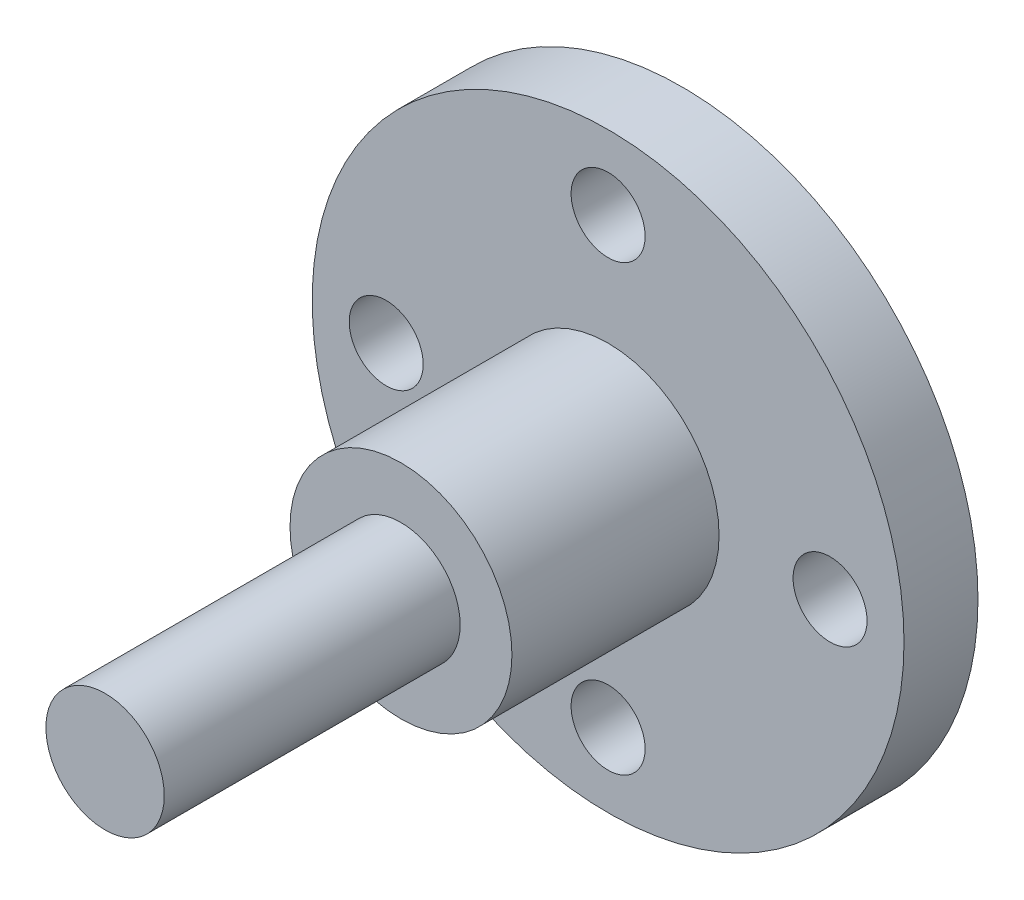
ISO-10303-21;
HEADER;
FILE_DESCRIPTION(('STEP AP214'),'2;1');
FILE_NAME('part.step','',(''),(''),'','','');
FILE_SCHEMA(('AUTOMOTIVE_DESIGN { 1 0 10303 214 1 1 1 1 }'));
ENDSEC;
DATA;
#1=APPLICATION_CONTEXT('core data for automotive mechanical design processes');
#2=APPLICATION_PROTOCOL_DEFINITION('international standard','automotive_design',2000,#1);
#3=PRODUCT_CONTEXT('',#1,'mechanical');
#4=PRODUCT('Part','Part','',(#3));
#5=PRODUCT_RELATED_PRODUCT_CATEGORY('part','',(#4));
#6=PRODUCT_DEFINITION_FORMATION('','',#4);
#7=PRODUCT_DEFINITION_CONTEXT('part definition',#1,'design');
#8=PRODUCT_DEFINITION('design','',#6,#7);
#9=PRODUCT_DEFINITION_SHAPE('','',#8);
#10=(LENGTH_UNIT() NAMED_UNIT(*) SI_UNIT(.MILLI.,.METRE.));
#11=(NAMED_UNIT(*) PLANE_ANGLE_UNIT() SI_UNIT($,.RADIAN.));
#12=(NAMED_UNIT(*) SI_UNIT($,.STERADIAN.) SOLID_ANGLE_UNIT());
#13=UNCERTAINTY_MEASURE_WITH_UNIT(LENGTH_MEASURE(1.E-05),#10,'distance_accuracy_value','');
#14=(GEOMETRIC_REPRESENTATION_CONTEXT(3) GLOBAL_UNCERTAINTY_ASSIGNED_CONTEXT((#13)) GLOBAL_UNIT_ASSIGNED_CONTEXT((#10,
#11,#12)) REPRESENTATION_CONTEXT('',''));
#15=CARTESIAN_POINT('',(0.,0.,0.));
#16=DIRECTION('',(0.,0.,1.));
#17=DIRECTION('',(1.,0.,0.));
#18=AXIS2_PLACEMENT_3D('',#15,#16,#17);
#19=CARTESIAN_POINT('',(0.,0.,5.));
#20=DIRECTION('',(0.,0.,-1.));
#21=DIRECTION('',(-1.,0.,0.));
#22=AXIS2_PLACEMENT_3D('',#19,#20,#21);
#23=CYLINDRICAL_SURFACE('',#22,20.);
#24=CARTESIAN_POINT('',(0.,0.,5.));
#25=DIRECTION('',(0.,0.,1.));
#26=DIRECTION('',(1.,0.,0.));
#27=AXIS2_PLACEMENT_3D('',#24,#25,#26);
#28=CIRCLE('',#27,20.);
#29=CARTESIAN_POINT('',(20.,0.,5.));
#30=VERTEX_POINT('',#29);
#31=EDGE_CURVE('E55',#30,#30,#28,.T.);
#32=ORIENTED_EDGE('',*,*,#31,.F.);
#33=EDGE_LOOP('',(#32));
#34=FACE_BOUND('',#33,.T.);
#35=CARTESIAN_POINT('',(0.,0.,0.));
#36=DIRECTION('',(0.,0.,1.));
#37=DIRECTION('',(1.,0.,0.));
#38=AXIS2_PLACEMENT_3D('',#35,#36,#37);
#39=CIRCLE('',#38,20.);
#40=CARTESIAN_POINT('',(20.,0.,0.));
#41=VERTEX_POINT('',#40);
#42=EDGE_CURVE('E64',#41,#41,#39,.T.);
#43=ORIENTED_EDGE('',*,*,#42,.T.);
#44=EDGE_LOOP('',(#43));
#45=FACE_BOUND('',#44,.T.);
#46=ADVANCED_FACE('F41',(#34,#45),#23,.T.);
#47=CARTESIAN_POINT('',(0.,0.,5.));
#48=DIRECTION('',(0.,0.,1.));
#49=DIRECTION('',(1.,0.,0.));
#50=AXIS2_PLACEMENT_3D('',#47,#48,#49);
#51=PLANE('',#50);
#52=CARTESIAN_POINT('',(0.,15.,5.));
#53=DIRECTION('',(0.,0.,1.));
#54=DIRECTION('',(1.,0.,0.));
#55=AXIS2_PLACEMENT_3D('',#52,#53,#54);
#56=CIRCLE('',#55,2.5);
#57=CARTESIAN_POINT('',(2.5,15.,5.));
#58=VERTEX_POINT('',#57);
#59=EDGE_CURVE('E77',#58,#58,#56,.T.);
#60=ORIENTED_EDGE('',*,*,#59,.F.);
#61=EDGE_LOOP('',(#60));
#62=FACE_BOUND('',#61,.T.);
#63=CARTESIAN_POINT('',(15.0000000000004,4.23570186157979E-13,5.));
#64=DIRECTION('',(0.,0.,1.));
#65=DIRECTION('',(1.,0.,0.));
#66=AXIS2_PLACEMENT_3D('',#63,#64,#65);
#67=CIRCLE('',#66,2.5);
#68=CARTESIAN_POINT('',(17.5000000000004,4.23570186157979E-13,5.));
#69=VERTEX_POINT('',#68);
#70=EDGE_CURVE('E156',#69,#69,#67,.T.);
#71=ORIENTED_EDGE('',*,*,#70,.F.);
#72=EDGE_LOOP('',(#71));
#73=FACE_BOUND('',#72,.T.);
#74=CARTESIAN_POINT('',(8.47140372315957E-13,-15.,5.));
#75=DIRECTION('',(0.,0.,1.));
#76=DIRECTION('',(1.,0.,0.));
#77=AXIS2_PLACEMENT_3D('',#74,#75,#76);
#78=CIRCLE('',#77,2.5);
#79=CARTESIAN_POINT('',(2.50000000000085,-15.,5.));
#80=VERTEX_POINT('',#79);
#81=EDGE_CURVE('E160',#80,#80,#78,.T.);
#82=ORIENTED_EDGE('',*,*,#81,.F.);
#83=EDGE_LOOP('',(#82));
#84=FACE_BOUND('',#83,.T.);
#85=CARTESIAN_POINT('',(-14.9999999999996,-4.254071563567E-13,5.));
#86=DIRECTION('',(0.,0.,1.));
#87=DIRECTION('',(1.,0.,0.));
#88=AXIS2_PLACEMENT_3D('',#85,#86,#87);
#89=CIRCLE('',#88,2.5);
#90=CARTESIAN_POINT('',(-12.4999999999996,-4.254071563567E-13,5.));
#91=VERTEX_POINT('',#90);
#92=EDGE_CURVE('E165',#91,#91,#89,.T.);
#93=ORIENTED_EDGE('',*,*,#92,.F.);
#94=EDGE_LOOP('',(#93));
#95=FACE_BOUND('',#94,.T.);
#96=CARTESIAN_POINT('',(0.,0.,5.));
#97=DIRECTION('',(0.,0.,1.));
#98=DIRECTION('',(1.,0.,0.));
#99=AXIS2_PLACEMENT_3D('',#96,#97,#98);
#100=CIRCLE('',#99,7.5);
#101=CARTESIAN_POINT('',(7.5,0.,5.));
#102=VERTEX_POINT('',#101);
#103=EDGE_CURVE('E49',#102,#102,#100,.T.);
#104=ORIENTED_EDGE('',*,*,#103,.F.);
#105=EDGE_LOOP('',(#104));
#106=FACE_BOUND('',#105,.T.);
#107=ORIENTED_EDGE('',*,*,#31,.T.);
#108=EDGE_LOOP('',(#107));
#109=FACE_BOUND('',#108,.T.);
#110=ADVANCED_FACE('F109',(#62,#73,#84,#95,#106,#109),#51,.T.);
#111=CARTESIAN_POINT('',(0.,0.,0.));
#112=DIRECTION('',(0.,0.,1.));
#113=DIRECTION('',(1.,0.,0.));
#114=AXIS2_PLACEMENT_3D('',#111,#112,#113);
#115=PLANE('',#114);
#116=CARTESIAN_POINT('',(0.,15.,0.));
#117=DIRECTION('',(0.,0.,1.));
#118=DIRECTION('',(1.,0.,0.));
#119=AXIS2_PLACEMENT_3D('',#116,#117,#118);
#120=CIRCLE('',#119,2.5);
#121=CARTESIAN_POINT('',(2.5,15.,0.));
#122=VERTEX_POINT('',#121);
#123=EDGE_CURVE('E44',#122,#122,#120,.T.);
#124=ORIENTED_EDGE('',*,*,#123,.T.);
#125=EDGE_LOOP('',(#124));
#126=FACE_BOUND('',#125,.T.);
#127=CARTESIAN_POINT('',(15.0000000000004,4.23570186157979E-13,0.));
#128=DIRECTION('',(0.,0.,1.));
#129=DIRECTION('',(1.,0.,0.));
#130=AXIS2_PLACEMENT_3D('',#127,#128,#129);
#131=CIRCLE('',#130,2.5);
#132=CARTESIAN_POINT('',(17.5000000000004,4.23570186157979E-13,0.));
#133=VERTEX_POINT('',#132);
#134=EDGE_CURVE('E80',#133,#133,#131,.T.);
#135=ORIENTED_EDGE('',*,*,#134,.T.);
#136=EDGE_LOOP('',(#135));
#137=FACE_BOUND('',#136,.T.);
#138=CARTESIAN_POINT('',(8.47140372315957E-13,-15.,0.));
#139=DIRECTION('',(0.,0.,1.));
#140=DIRECTION('',(1.,0.,0.));
#141=AXIS2_PLACEMENT_3D('',#138,#139,#140);
#142=CIRCLE('',#141,2.5);
#143=CARTESIAN_POINT('',(2.50000000000085,-15.,0.));
#144=VERTEX_POINT('',#143);
#145=EDGE_CURVE('E76',#144,#144,#142,.T.);
#146=ORIENTED_EDGE('',*,*,#145,.T.);
#147=EDGE_LOOP('',(#146));
#148=FACE_BOUND('',#147,.T.);
#149=CARTESIAN_POINT('',(-14.9999999999996,-4.254071563567E-13,0.));
#150=DIRECTION('',(0.,0.,1.));
#151=DIRECTION('',(1.,0.,0.));
#152=AXIS2_PLACEMENT_3D('',#149,#150,#151);
#153=CIRCLE('',#152,2.5);
#154=CARTESIAN_POINT('',(-12.4999999999996,-4.254071563567E-13,0.));
#155=VERTEX_POINT('',#154);
#156=EDGE_CURVE('E72',#155,#155,#153,.T.);
#157=ORIENTED_EDGE('',*,*,#156,.T.);
#158=EDGE_LOOP('',(#157));
#159=FACE_BOUND('',#158,.T.);
#160=ORIENTED_EDGE('',*,*,#42,.F.);
#161=EDGE_LOOP('',(#160));
#162=FACE_BOUND('',#161,.T.);
#163=ADVANCED_FACE('F114',(#126,#137,#148,#159,#162),#115,.F.);
#164=CARTESIAN_POINT('',(0.,0.,19.));
#165=DIRECTION('',(0.,0.,-1.));
#166=DIRECTION('',(-1.,0.,0.));
#167=AXIS2_PLACEMENT_3D('',#164,#165,#166);
#168=CYLINDRICAL_SURFACE('',#167,7.5);
#169=CARTESIAN_POINT('',(0.,0.,19.));
#170=DIRECTION('',(0.,0.,1.));
#171=DIRECTION('',(1.,0.,0.));
#172=AXIS2_PLACEMENT_3D('',#169,#170,#171);
#173=CIRCLE('',#172,7.5);
#174=CARTESIAN_POINT('',(7.5,0.,19.));
#175=VERTEX_POINT('',#174);
#176=EDGE_CURVE('E61',#175,#175,#173,.T.);
#177=ORIENTED_EDGE('',*,*,#176,.F.);
#178=EDGE_LOOP('',(#177));
#179=FACE_BOUND('',#178,.T.);
#180=ORIENTED_EDGE('',*,*,#103,.T.);
#181=EDGE_LOOP('',(#180));
#182=FACE_BOUND('',#181,.T.);
#183=ADVANCED_FACE('F105',(#179,#182),#168,.T.);
#184=CARTESIAN_POINT('',(0.,0.,19.));
#185=DIRECTION('',(0.,0.,1.));
#186=DIRECTION('',(1.,0.,0.));
#187=AXIS2_PLACEMENT_3D('',#184,#185,#186);
#188=PLANE('',#187);
#189=CARTESIAN_POINT('',(0.,0.,19.));
#190=DIRECTION('',(0.,0.,1.));
#191=DIRECTION('',(1.,0.,0.));
#192=AXIS2_PLACEMENT_3D('',#189,#190,#191);
#193=CIRCLE('',#192,4.);
#194=CARTESIAN_POINT('',(4.,0.,19.));
#195=VERTEX_POINT('',#194);
#196=EDGE_CURVE('E10',#195,#195,#193,.T.);
#197=ORIENTED_EDGE('',*,*,#196,.F.);
#198=EDGE_LOOP('',(#197));
#199=FACE_BOUND('',#198,.T.);
#200=ORIENTED_EDGE('',*,*,#176,.T.);
#201=EDGE_LOOP('',(#200));
#202=FACE_BOUND('',#201,.T.);
#203=ADVANCED_FACE('F97',(#199,#202),#188,.T.);
#204=CARTESIAN_POINT('',(0.,0.,39.));
#205=DIRECTION('',(0.,0.,-1.));
#206=DIRECTION('',(-1.,0.,0.));
#207=AXIS2_PLACEMENT_3D('',#204,#205,#206);
#208=CYLINDRICAL_SURFACE('',#207,4.);
#209=CARTESIAN_POINT('',(0.,0.,39.));
#210=DIRECTION('',(0.,0.,1.));
#211=DIRECTION('',(1.,0.,0.));
#212=AXIS2_PLACEMENT_3D('',#209,#210,#211);
#213=CIRCLE('',#212,4.);
#214=CARTESIAN_POINT('',(4.,0.,39.));
#215=VERTEX_POINT('',#214);
#216=EDGE_CURVE('E59',#215,#215,#213,.T.);
#217=ORIENTED_EDGE('',*,*,#216,.F.);
#218=EDGE_LOOP('',(#217));
#219=FACE_BOUND('',#218,.T.);
#220=ORIENTED_EDGE('',*,*,#196,.T.);
#221=EDGE_LOOP('',(#220));
#222=FACE_BOUND('',#221,.T.);
#223=ADVANCED_FACE('F95',(#219,#222),#208,.T.);
#224=CARTESIAN_POINT('',(0.,0.,39.));
#225=DIRECTION('',(0.,0.,1.));
#226=DIRECTION('',(1.,0.,0.));
#227=AXIS2_PLACEMENT_3D('',#224,#225,#226);
#228=PLANE('',#227);
#229=ORIENTED_EDGE('',*,*,#216,.T.);
#230=EDGE_LOOP('',(#229));
#231=FACE_BOUND('',#230,.T.);
#232=ADVANCED_FACE('F93',(#231),#228,.T.);
#233=CARTESIAN_POINT('',(-14.9999999999996,-4.254071563567E-13,-15.));
#234=DIRECTION('',(0.,0.,1.));
#235=DIRECTION('',(1.,0.,0.));
#236=AXIS2_PLACEMENT_3D('',#233,#234,#235);
#237=CYLINDRICAL_SURFACE('',#236,2.5);
#238=ORIENTED_EDGE('',*,*,#92,.T.);
#239=EDGE_LOOP('',(#238));
#240=FACE_BOUND('',#239,.T.);
#241=ORIENTED_EDGE('',*,*,#156,.F.);
#242=EDGE_LOOP('',(#241));
#243=FACE_BOUND('',#242,.T.);
#244=ADVANCED_FACE('F103',(#240,#243),#237,.F.);
#245=CARTESIAN_POINT('',(8.47140372315957E-13,-15.,-15.));
#246=DIRECTION('',(0.,0.,1.));
#247=DIRECTION('',(1.,0.,0.));
#248=AXIS2_PLACEMENT_3D('',#245,#246,#247);
#249=CYLINDRICAL_SURFACE('',#248,2.5);
#250=ORIENTED_EDGE('',*,*,#81,.T.);
#251=EDGE_LOOP('',(#250));
#252=FACE_BOUND('',#251,.T.);
#253=ORIENTED_EDGE('',*,*,#145,.F.);
#254=EDGE_LOOP('',(#253));
#255=FACE_BOUND('',#254,.T.);
#256=ADVANCED_FACE('F133',(#252,#255),#249,.F.);
#257=CARTESIAN_POINT('',(15.0000000000004,4.23570186157979E-13,-15.));
#258=DIRECTION('',(0.,0.,1.));
#259=DIRECTION('',(1.,0.,0.));
#260=AXIS2_PLACEMENT_3D('',#257,#258,#259);
#261=CYLINDRICAL_SURFACE('',#260,2.5);
#262=ORIENTED_EDGE('',*,*,#70,.T.);
#263=EDGE_LOOP('',(#262));
#264=FACE_BOUND('',#263,.T.);
#265=ORIENTED_EDGE('',*,*,#134,.F.);
#266=EDGE_LOOP('',(#265));
#267=FACE_BOUND('',#266,.T.);
#268=ADVANCED_FACE('F139',(#264,#267),#261,.F.);
#269=CARTESIAN_POINT('',(0.,15.,-15.));
#270=DIRECTION('',(0.,0.,1.));
#271=DIRECTION('',(1.,0.,0.));
#272=AXIS2_PLACEMENT_3D('',#269,#270,#271);
#273=CYLINDRICAL_SURFACE('',#272,2.5);
#274=ORIENTED_EDGE('',*,*,#59,.T.);
#275=EDGE_LOOP('',(#274));
#276=FACE_BOUND('',#275,.T.);
#277=ORIENTED_EDGE('',*,*,#123,.F.);
#278=EDGE_LOOP('',(#277));
#279=FACE_BOUND('',#278,.T.);
#280=ADVANCED_FACE('F146',(#276,#279),#273,.F.);
#281=CLOSED_SHELL('',(#46,#110,#163,#183,#203,#223,#232,#244,#256,#268,#280));
#282=MANIFOLD_SOLID_BREP('B2',#281);
#283=ADVANCED_BREP_SHAPE_REPRESENTATION('',(#18,#282),#14);
#284=SHAPE_DEFINITION_REPRESENTATION(#9,#283);
ENDSEC;
END-ISO-10303-21;
